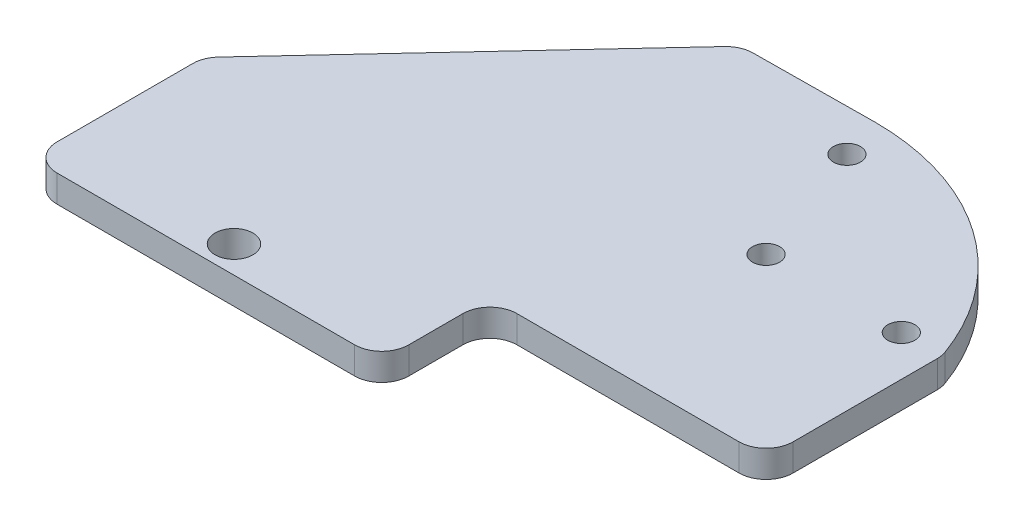
ISO-10303-21;
HEADER;
FILE_DESCRIPTION(('STEP AP214'),'2;1');
FILE_NAME('part.step','',(''),(''),'','','');
FILE_SCHEMA(('AUTOMOTIVE_DESIGN { 1 0 10303 214 1 1 1 1 }'));
ENDSEC;
DATA;
#1=APPLICATION_CONTEXT('core data for automotive mechanical design processes');
#2=APPLICATION_PROTOCOL_DEFINITION('international standard','automotive_design',2000,#1);
#3=PRODUCT_CONTEXT('',#1,'mechanical');
#4=PRODUCT('Part','Part','',(#3));
#5=PRODUCT_RELATED_PRODUCT_CATEGORY('part','',(#4));
#6=PRODUCT_DEFINITION_FORMATION('','',#4);
#7=PRODUCT_DEFINITION_CONTEXT('part definition',#1,'design');
#8=PRODUCT_DEFINITION('design','',#6,#7);
#9=PRODUCT_DEFINITION_SHAPE('','',#8);
#10=(LENGTH_UNIT() NAMED_UNIT(*) SI_UNIT(.MILLI.,.METRE.));
#11=(NAMED_UNIT(*) PLANE_ANGLE_UNIT() SI_UNIT($,.RADIAN.));
#12=(NAMED_UNIT(*) SI_UNIT($,.STERADIAN.) SOLID_ANGLE_UNIT());
#13=UNCERTAINTY_MEASURE_WITH_UNIT(LENGTH_MEASURE(1.E-05),#10,'distance_accuracy_value','');
#14=(GEOMETRIC_REPRESENTATION_CONTEXT(3) GLOBAL_UNCERTAINTY_ASSIGNED_CONTEXT((#13)) GLOBAL_UNIT_ASSIGNED_CONTEXT((#10,
#11,#12)) REPRESENTATION_CONTEXT('',''));
#15=CARTESIAN_POINT('',(0.,0.,0.));
#16=DIRECTION('',(0.,0.,1.));
#17=DIRECTION('',(1.,0.,0.));
#18=AXIS2_PLACEMENT_3D('',#15,#16,#17);
#19=CARTESIAN_POINT('',(-34.7983001151033,10.,-117.080751783085));
#20=DIRECTION('',(0.,-1.,0.));
#21=DIRECTION('',(0.,0.,-1.));
#22=AXIS2_PLACEMENT_3D('',#19,#20,#21);
#23=CYLINDRICAL_SURFACE('',#22,9.99999999999999);
#24=CARTESIAN_POINT('',(-34.7983001151033,0.,-117.080751783085));
#25=DIRECTION('',(0.,1.,0.));
#26=DIRECTION('',(0.,0.,-1.));
#27=AXIS2_PLACEMENT_3D('',#24,#25,#26);
#28=CIRCLE('',#27,9.99999999999999);
#29=CARTESIAN_POINT('',(-34.9535044317094,0.,-127.07954729155));
#30=VERTEX_POINT('',#29);
#31=CARTESIAN_POINT('',(-42.1194135361715,0.,-123.892601625518));
#32=VERTEX_POINT('',#31);
#33=EDGE_CURVE('E176',#30,#32,#28,.T.);
#34=ORIENTED_EDGE('',*,*,#33,.T.);
#35=DIRECTION('',(0.,-1.,0.));
#36=VECTOR('',#35,1.);
#37=CARTESIAN_POINT('',(-42.1194135361715,10.,-123.892601625518));
#38=LINE('',#37,#36);
#39=CARTESIAN_POINT('',(-42.1194135361715,10.,-123.892601625518));
#40=VERTEX_POINT('',#39);
#41=EDGE_CURVE('E11',#40,#32,#38,.T.);
#42=ORIENTED_EDGE('',*,*,#41,.F.);
#43=CARTESIAN_POINT('',(-34.7983001151033,10.,-117.080751783085));
#44=DIRECTION('',(0.,1.,0.));
#45=DIRECTION('',(0.,0.,-1.));
#46=AXIS2_PLACEMENT_3D('',#43,#44,#45);
#47=CIRCLE('',#46,9.99999999999999);
#48=CARTESIAN_POINT('',(-34.9535044317094,10.,-127.07954729155));
#49=VERTEX_POINT('',#48);
#50=EDGE_CURVE('E204',#49,#40,#47,.T.);
#51=ORIENTED_EDGE('',*,*,#50,.F.);
#52=DIRECTION('',(0.,-1.,0.));
#53=VECTOR('',#52,1.);
#54=CARTESIAN_POINT('',(-34.9535044317094,10.,-127.07954729155));
#55=LINE('',#54,#53);
#56=EDGE_CURVE('E172',#49,#30,#55,.T.);
#57=ORIENTED_EDGE('',*,*,#56,.T.);
#58=EDGE_LOOP('',(#34,#42,#51,#57));
#59=FACE_BOUND('',#58,.T.);
#60=ADVANCED_FACE('F36',(#59),#23,.T.);
#61=CARTESIAN_POINT('',(-132.321113421068,10.,-26.9472944173652));
#62=DIRECTION('',(0.732111342106818,0.,0.681184984243307));
#63=DIRECTION('',(0.681184984243307,0.,-0.732111342106818));
#64=AXIS2_PLACEMENT_3D('',#61,#62,#63);
#65=PLANE('',#64);
#66=DIRECTION('',(-0.681184984243307,0.,0.732111342106818));
#67=VECTOR('',#66,1.);
#68=CARTESIAN_POINT('',(-132.321113421068,0.,-26.9472944173652));
#69=LINE('',#68,#67);
#70=CARTESIAN_POINT('',(-132.321113421068,0.,-26.9472944173652));
#71=VERTEX_POINT('',#70);
#72=EDGE_CURVE('E179',#32,#71,#69,.T.);
#73=ORIENTED_EDGE('',*,*,#72,.T.);
#74=DIRECTION('',(0.,-1.,0.));
#75=VECTOR('',#74,1.);
#76=CARTESIAN_POINT('',(-132.321113421068,10.,-26.9472944173652));
#77=LINE('',#76,#75);
#78=CARTESIAN_POINT('',(-132.321113421068,10.,-26.9472944173652));
#79=VERTEX_POINT('',#78);
#80=EDGE_CURVE('E45',#79,#71,#77,.T.);
#81=ORIENTED_EDGE('',*,*,#80,.F.);
#82=DIRECTION('',(-0.681184984243307,0.,0.732111342106818));
#83=VECTOR('',#82,1.);
#84=CARTESIAN_POINT('',(-132.321113421068,10.,-26.9472944173652));
#85=LINE('',#84,#83);
#86=EDGE_CURVE('E118',#40,#79,#85,.T.);
#87=ORIENTED_EDGE('',*,*,#86,.F.);
#88=ORIENTED_EDGE('',*,*,#41,.T.);
#89=EDGE_LOOP('',(#73,#81,#87,#88));
#90=FACE_BOUND('',#89,.T.);
#91=ADVANCED_FACE('F275',(#90),#65,.F.);
#92=CARTESIAN_POINT('',(-125.,10.,-20.1354445749322));
#93=DIRECTION('',(0.,-1.,0.));
#94=DIRECTION('',(0.,0.,-1.));
#95=AXIS2_PLACEMENT_3D('',#92,#93,#94);
#96=CYLINDRICAL_SURFACE('',#95,9.99999999999999);
#97=CARTESIAN_POINT('',(-125.,0.,-20.1354445749322));
#98=DIRECTION('',(0.,1.,0.));
#99=DIRECTION('',(0.,0.,-1.));
#100=AXIS2_PLACEMENT_3D('',#97,#98,#99);
#101=CIRCLE('',#100,9.99999999999999);
#102=CARTESIAN_POINT('',(-135.,0.,-20.1354445749321));
#103=VERTEX_POINT('',#102);
#104=EDGE_CURVE('E181',#71,#103,#101,.T.);
#105=ORIENTED_EDGE('',*,*,#104,.T.);
#106=DIRECTION('',(0.,-1.,0.));
#107=VECTOR('',#106,1.);
#108=CARTESIAN_POINT('',(-135.,10.,-20.1354445749321));
#109=LINE('',#108,#107);
#110=CARTESIAN_POINT('',(-135.,10.,-20.1354445749321));
#111=VERTEX_POINT('',#110);
#112=EDGE_CURVE('E232',#111,#103,#109,.T.);
#113=ORIENTED_EDGE('',*,*,#112,.F.);
#114=CARTESIAN_POINT('',(-125.,10.,-20.1354445749322));
#115=DIRECTION('',(0.,1.,0.));
#116=DIRECTION('',(0.,0.,-1.));
#117=AXIS2_PLACEMENT_3D('',#114,#115,#116);
#118=CIRCLE('',#117,9.99999999999999);
#119=EDGE_CURVE('E407',#79,#111,#118,.T.);
#120=ORIENTED_EDGE('',*,*,#119,.F.);
#121=ORIENTED_EDGE('',*,*,#80,.T.);
#122=EDGE_LOOP('',(#105,#113,#120,#121));
#123=FACE_BOUND('',#122,.T.);
#124=ADVANCED_FACE('F279',(#123),#96,.T.);
#125=CARTESIAN_POINT('',(-135.,10.,30.0000000000002));
#126=DIRECTION('',(1.,0.,0.));
#127=DIRECTION('',(0.,0.,-1.));
#128=AXIS2_PLACEMENT_3D('',#125,#126,#127);
#129=PLANE('',#128);
#130=DIRECTION('',(0.,0.,1.));
#131=VECTOR('',#130,1.);
#132=CARTESIAN_POINT('',(-135.,0.,30.0000000000002));
#133=LINE('',#132,#131);
#134=CARTESIAN_POINT('',(-135.,0.,30.0000000000002));
#135=VERTEX_POINT('',#134);
#136=EDGE_CURVE('E183',#103,#135,#133,.T.);
#137=ORIENTED_EDGE('',*,*,#136,.T.);
#138=DIRECTION('',(0.,-1.,0.));
#139=VECTOR('',#138,1.);
#140=CARTESIAN_POINT('',(-135.,10.,30.0000000000002));
#141=LINE('',#140,#139);
#142=CARTESIAN_POINT('',(-135.,10.,30.0000000000002));
#143=VERTEX_POINT('',#142);
#144=EDGE_CURVE('E229',#143,#135,#141,.T.);
#145=ORIENTED_EDGE('',*,*,#144,.F.);
#146=DIRECTION('',(0.,0.,1.));
#147=VECTOR('',#146,1.);
#148=CARTESIAN_POINT('',(-135.,10.,30.0000000000002));
#149=LINE('',#148,#147);
#150=EDGE_CURVE('E409',#111,#143,#149,.T.);
#151=ORIENTED_EDGE('',*,*,#150,.F.);
#152=ORIENTED_EDGE('',*,*,#112,.T.);
#153=EDGE_LOOP('',(#137,#145,#151,#152));
#154=FACE_BOUND('',#153,.T.);
#155=ADVANCED_FACE('F283',(#154),#129,.F.);
#156=CARTESIAN_POINT('',(-125.,10.,30.0000000000002));
#157=DIRECTION('',(0.,-1.,0.));
#158=DIRECTION('',(0.,0.,-1.));
#159=AXIS2_PLACEMENT_3D('',#156,#157,#158);
#160=CYLINDRICAL_SURFACE('',#159,10.);
#161=CARTESIAN_POINT('',(-125.,0.,30.0000000000002));
#162=DIRECTION('',(0.,1.,0.));
#163=DIRECTION('',(0.,0.,-1.));
#164=AXIS2_PLACEMENT_3D('',#161,#162,#163);
#165=CIRCLE('',#164,10.);
#166=CARTESIAN_POINT('',(-125.,0.,40.0000000000002));
#167=VERTEX_POINT('',#166);
#168=EDGE_CURVE('E185',#135,#167,#165,.T.);
#169=ORIENTED_EDGE('',*,*,#168,.T.);
#170=DIRECTION('',(0.,-1.,0.));
#171=VECTOR('',#170,1.);
#172=CARTESIAN_POINT('',(-125.,10.,40.0000000000002));
#173=LINE('',#172,#171);
#174=CARTESIAN_POINT('',(-125.,10.,40.0000000000002));
#175=VERTEX_POINT('',#174);
#176=EDGE_CURVE('E226',#175,#167,#173,.T.);
#177=ORIENTED_EDGE('',*,*,#176,.F.);
#178=CARTESIAN_POINT('',(-125.,10.,30.0000000000002));
#179=DIRECTION('',(0.,1.,0.));
#180=DIRECTION('',(0.,0.,-1.));
#181=AXIS2_PLACEMENT_3D('',#178,#179,#180);
#182=CIRCLE('',#181,10.);
#183=EDGE_CURVE('E411',#143,#175,#182,.T.);
#184=ORIENTED_EDGE('',*,*,#183,.F.);
#185=ORIENTED_EDGE('',*,*,#144,.T.);
#186=EDGE_LOOP('',(#169,#177,#184,#185));
#187=FACE_BOUND('',#186,.T.);
#188=ADVANCED_FACE('F289',(#187),#160,.T.);
#189=CARTESIAN_POINT('',(-15.0000000000001,10.,40.0000000000002));
#190=DIRECTION('',(0.,0.,-1.));
#191=DIRECTION('',(-1.,0.,0.));
#192=AXIS2_PLACEMENT_3D('',#189,#190,#191);
#193=PLANE('',#192);
#194=DIRECTION('',(1.,0.,0.));
#195=VECTOR('',#194,1.);
#196=CARTESIAN_POINT('',(-15.0000000000001,0.,40.0000000000002));
#197=LINE('',#196,#195);
#198=CARTESIAN_POINT('',(-15.0000000000001,0.,40.0000000000002));
#199=VERTEX_POINT('',#198);
#200=EDGE_CURVE('E187',#167,#199,#197,.T.);
#201=ORIENTED_EDGE('',*,*,#200,.T.);
#202=DIRECTION('',(0.,-1.,0.));
#203=VECTOR('',#202,1.);
#204=CARTESIAN_POINT('',(-15.0000000000001,10.,40.0000000000002));
#205=LINE('',#204,#203);
#206=CARTESIAN_POINT('',(-15.0000000000001,10.,40.0000000000002));
#207=VERTEX_POINT('',#206);
#208=EDGE_CURVE('E223',#207,#199,#205,.T.);
#209=ORIENTED_EDGE('',*,*,#208,.F.);
#210=DIRECTION('',(1.,0.,0.));
#211=VECTOR('',#210,1.);
#212=CARTESIAN_POINT('',(-15.0000000000001,10.,40.0000000000002));
#213=LINE('',#212,#211);
#214=EDGE_CURVE('E413',#175,#207,#213,.T.);
#215=ORIENTED_EDGE('',*,*,#214,.F.);
#216=ORIENTED_EDGE('',*,*,#176,.T.);
#217=EDGE_LOOP('',(#201,#209,#215,#216));
#218=FACE_BOUND('',#217,.T.);
#219=ADVANCED_FACE('F293',(#218),#193,.F.);
#220=CARTESIAN_POINT('',(-15.0000000000001,10.,30.0000000000002));
#221=DIRECTION('',(0.,-1.,0.));
#222=DIRECTION('',(0.,0.,-1.));
#223=AXIS2_PLACEMENT_3D('',#220,#221,#222);
#224=CYLINDRICAL_SURFACE('',#223,10.);
#225=CARTESIAN_POINT('',(-15.0000000000001,0.,30.0000000000002));
#226=DIRECTION('',(0.,1.,0.));
#227=DIRECTION('',(0.,0.,1.));
#228=AXIS2_PLACEMENT_3D('',#225,#226,#227);
#229=CIRCLE('',#228,10.);
#230=CARTESIAN_POINT('',(-5.00000000000007,0.,30.0000000000002));
#231=VERTEX_POINT('',#230);
#232=EDGE_CURVE('E189',#199,#231,#229,.T.);
#233=ORIENTED_EDGE('',*,*,#232,.T.);
#234=DIRECTION('',(0.,-1.,0.));
#235=VECTOR('',#234,1.);
#236=CARTESIAN_POINT('',(-5.00000000000007,10.,30.0000000000002));
#237=LINE('',#236,#235);
#238=CARTESIAN_POINT('',(-5.00000000000007,10.,30.0000000000002));
#239=VERTEX_POINT('',#238);
#240=EDGE_CURVE('E220',#239,#231,#237,.T.);
#241=ORIENTED_EDGE('',*,*,#240,.F.);
#242=CARTESIAN_POINT('',(-15.0000000000001,10.,30.0000000000002));
#243=DIRECTION('',(0.,1.,0.));
#244=DIRECTION('',(0.,0.,1.));
#245=AXIS2_PLACEMENT_3D('',#242,#243,#244);
#246=CIRCLE('',#245,10.);
#247=EDGE_CURVE('E415',#207,#239,#246,.T.);
#248=ORIENTED_EDGE('',*,*,#247,.F.);
#249=ORIENTED_EDGE('',*,*,#208,.T.);
#250=EDGE_LOOP('',(#233,#241,#248,#249));
#251=FACE_BOUND('',#250,.T.);
#252=ADVANCED_FACE('F297',(#251),#224,.T.);
#253=CARTESIAN_POINT('',(-5.00000000000007,10.,10.0000000000001));
#254=DIRECTION('',(-1.,0.,0.));
#255=DIRECTION('',(0.,0.,1.));
#256=AXIS2_PLACEMENT_3D('',#253,#254,#255);
#257=PLANE('',#256);
#258=DIRECTION('',(0.,0.,-1.));
#259=VECTOR('',#258,1.);
#260=CARTESIAN_POINT('',(-5.00000000000007,0.,10.0000000000001));
#261=LINE('',#260,#259);
#262=CARTESIAN_POINT('',(-5.00000000000007,0.,10.0000000000001));
#263=VERTEX_POINT('',#262);
#264=EDGE_CURVE('E191',#231,#263,#261,.T.);
#265=ORIENTED_EDGE('',*,*,#264,.T.);
#266=DIRECTION('',(0.,-1.,0.));
#267=VECTOR('',#266,1.);
#268=CARTESIAN_POINT('',(-5.00000000000007,10.,10.0000000000001));
#269=LINE('',#268,#267);
#270=CARTESIAN_POINT('',(-5.00000000000007,10.,10.0000000000001));
#271=VERTEX_POINT('',#270);
#272=EDGE_CURVE('E217',#271,#263,#269,.T.);
#273=ORIENTED_EDGE('',*,*,#272,.F.);
#274=DIRECTION('',(0.,0.,-1.));
#275=VECTOR('',#274,1.);
#276=CARTESIAN_POINT('',(-5.00000000000007,10.,10.0000000000001));
#277=LINE('',#276,#275);
#278=EDGE_CURVE('E417',#239,#271,#277,.T.);
#279=ORIENTED_EDGE('',*,*,#278,.F.);
#280=ORIENTED_EDGE('',*,*,#240,.T.);
#281=EDGE_LOOP('',(#265,#273,#279,#280));
#282=FACE_BOUND('',#281,.T.);
#283=ADVANCED_FACE('F301',(#282),#257,.F.);
#284=CARTESIAN_POINT('',(4.99999999999992,10.,10.));
#285=DIRECTION('',(0.,-1.,0.));
#286=DIRECTION('',(0.,0.,-1.));
#287=AXIS2_PLACEMENT_3D('',#284,#285,#286);
#288=CYLINDRICAL_SURFACE('',#287,10.);
#289=CARTESIAN_POINT('',(4.99999999999992,0.,10.));
#290=DIRECTION('',(0.,-1.,0.));
#291=DIRECTION('',(0.,0.,-1.));
#292=AXIS2_PLACEMENT_3D('',#289,#290,#291);
#293=CIRCLE('',#292,10.);
#294=CARTESIAN_POINT('',(4.99999999999992,0.,0.));
#295=VERTEX_POINT('',#294);
#296=EDGE_CURVE('E193',#263,#295,#293,.T.);
#297=ORIENTED_EDGE('',*,*,#296,.T.);
#298=DIRECTION('',(0.,-1.,0.));
#299=VECTOR('',#298,1.);
#300=CARTESIAN_POINT('',(4.99999999999992,10.,0.));
#301=LINE('',#300,#299);
#302=CARTESIAN_POINT('',(4.99999999999992,10.,0.));
#303=VERTEX_POINT('',#302);
#304=EDGE_CURVE('E214',#303,#295,#301,.T.);
#305=ORIENTED_EDGE('',*,*,#304,.F.);
#306=CARTESIAN_POINT('',(4.99999999999992,10.,10.));
#307=DIRECTION('',(0.,-1.,0.));
#308=DIRECTION('',(0.,0.,-1.));
#309=AXIS2_PLACEMENT_3D('',#306,#307,#308);
#310=CIRCLE('',#309,10.);
#311=EDGE_CURVE('E419',#271,#303,#310,.T.);
#312=ORIENTED_EDGE('',*,*,#311,.F.);
#313=ORIENTED_EDGE('',*,*,#272,.T.);
#314=EDGE_LOOP('',(#297,#305,#312,#313));
#315=FACE_BOUND('',#314,.T.);
#316=ADVANCED_FACE('F305',(#315),#288,.F.);
#317=CARTESIAN_POINT('',(5.,10.,0.));
#318=DIRECTION('',(0.,0.,-1.));
#319=DIRECTION('',(-1.,0.,0.));
#320=AXIS2_PLACEMENT_3D('',#317,#318,#319);
#321=PLANE('',#320);
#322=DIRECTION('',(1.,0.,0.));
#323=VECTOR('',#322,1.);
#324=CARTESIAN_POINT('',(5.,0.,0.));
#325=LINE('',#324,#323);
#326=CARTESIAN_POINT('',(87.0999999999999,0.,0.));
#327=VERTEX_POINT('',#326);
#328=EDGE_CURVE('E195',#295,#327,#325,.T.);
#329=ORIENTED_EDGE('',*,*,#328,.T.);
#330=DIRECTION('',(0.,-1.,0.));
#331=VECTOR('',#330,1.);
#332=CARTESIAN_POINT('',(87.0999999999999,10.,0.));
#333=LINE('',#332,#331);
#334=CARTESIAN_POINT('',(87.0999999999999,10.,0.));
#335=VERTEX_POINT('',#334);
#336=EDGE_CURVE('E211',#335,#327,#333,.T.);
#337=ORIENTED_EDGE('',*,*,#336,.F.);
#338=DIRECTION('',(1.,0.,0.));
#339=VECTOR('',#338,1.);
#340=CARTESIAN_POINT('',(5.,10.,0.));
#341=LINE('',#340,#339);
#342=EDGE_CURVE('E421',#303,#335,#341,.T.);
#343=ORIENTED_EDGE('',*,*,#342,.F.);
#344=ORIENTED_EDGE('',*,*,#304,.T.);
#345=EDGE_LOOP('',(#329,#337,#343,#344));
#346=FACE_BOUND('',#345,.T.);
#347=ADVANCED_FACE('F309',(#346),#321,.F.);
#348=CARTESIAN_POINT('',(87.1,10.,-10.));
#349=DIRECTION('',(0.,-1.,0.));
#350=DIRECTION('',(0.,0.,-1.));
#351=AXIS2_PLACEMENT_3D('',#348,#349,#350);
#352=CYLINDRICAL_SURFACE('',#351,10.);
#353=CARTESIAN_POINT('',(87.1,0.,-10.));
#354=DIRECTION('',(0.,1.,0.));
#355=DIRECTION('',(0.,0.,1.));
#356=AXIS2_PLACEMENT_3D('',#353,#354,#355);
#357=CIRCLE('',#356,10.);
#358=CARTESIAN_POINT('',(97.1,0.,-10.0000000000001));
#359=VERTEX_POINT('',#358);
#360=EDGE_CURVE('E197',#327,#359,#357,.T.);
#361=ORIENTED_EDGE('',*,*,#360,.T.);
#362=DIRECTION('',(0.,-1.,0.));
#363=VECTOR('',#362,1.);
#364=CARTESIAN_POINT('',(97.1,10.,-10.0000000000001));
#365=LINE('',#364,#363);
#366=CARTESIAN_POINT('',(97.1,10.,-10.0000000000001));
#367=VERTEX_POINT('',#366);
#368=EDGE_CURVE('E208',#367,#359,#365,.T.);
#369=ORIENTED_EDGE('',*,*,#368,.F.);
#370=CARTESIAN_POINT('',(87.1,10.,-10.));
#371=DIRECTION('',(0.,1.,0.));
#372=DIRECTION('',(0.,0.,1.));
#373=AXIS2_PLACEMENT_3D('',#370,#371,#372);
#374=CIRCLE('',#373,10.);
#375=EDGE_CURVE('E423',#335,#367,#374,.T.);
#376=ORIENTED_EDGE('',*,*,#375,.F.);
#377=ORIENTED_EDGE('',*,*,#336,.T.);
#378=EDGE_LOOP('',(#361,#369,#376,#377));
#379=FACE_BOUND('',#378,.T.);
#380=ADVANCED_FACE('F313',(#379),#352,.T.);
#381=CARTESIAN_POINT('',(97.1,10.,-10.0000000000001));
#382=DIRECTION('',(-1.,0.,0.));
#383=DIRECTION('',(0.,0.,1.));
#384=AXIS2_PLACEMENT_3D('',#381,#382,#383);
#385=PLANE('',#384);
#386=DIRECTION('',(0.,0.,-1.));
#387=VECTOR('',#386,1.);
#388=CARTESIAN_POINT('',(97.1,0.,-10.0000000000001));
#389=LINE('',#388,#387);
#390=CARTESIAN_POINT('',(97.1,0.,-63.2972088275292));
#391=VERTEX_POINT('',#390);
#392=EDGE_CURVE('E199',#359,#391,#389,.T.);
#393=ORIENTED_EDGE('',*,*,#392,.T.);
#394=DIRECTION('',(0.,-1.,0.));
#395=VECTOR('',#394,1.);
#396=CARTESIAN_POINT('',(97.1,10.,-63.2972088275292));
#397=LINE('',#396,#395);
#398=CARTESIAN_POINT('',(97.1,10.,-63.2972088275292));
#399=VERTEX_POINT('',#398);
#400=EDGE_CURVE('E167',#399,#391,#397,.T.);
#401=ORIENTED_EDGE('',*,*,#400,.F.);
#402=DIRECTION('',(0.,0.,-1.));
#403=VECTOR('',#402,1.);
#404=CARTESIAN_POINT('',(97.1,10.,-10.0000000000001));
#405=LINE('',#404,#403);
#406=EDGE_CURVE('E158',#367,#399,#405,.T.);
#407=ORIENTED_EDGE('',*,*,#406,.F.);
#408=ORIENTED_EDGE('',*,*,#368,.T.);
#409=EDGE_LOOP('',(#393,#401,#407,#408));
#410=FACE_BOUND('',#409,.T.);
#411=ADVANCED_FACE('F317',(#410),#385,.F.);
#412=CARTESIAN_POINT('',(87.1,10.,-63.2972088275292));
#413=DIRECTION('',(0.,-1.,0.));
#414=DIRECTION('',(0.,0.,-1.));
#415=AXIS2_PLACEMENT_3D('',#412,#413,#414);
#416=CYLINDRICAL_SURFACE('',#415,9.99999999999999);
#417=CARTESIAN_POINT('',(87.1,0.,-63.2972088275292));
#418=DIRECTION('',(0.,1.,0.));
#419=DIRECTION('',(0.,0.,-1.));
#420=AXIS2_PLACEMENT_3D('',#417,#418,#419);
#421=CIRCLE('',#420,9.99999999999999);
#422=CARTESIAN_POINT('',(96.5026593383159,0.,-66.70161734702));
#423=VERTEX_POINT('',#422);
#424=EDGE_CURVE('E166',#391,#423,#421,.T.);
#425=ORIENTED_EDGE('',*,*,#424,.T.);
#426=DIRECTION('',(0.,-1.,0.));
#427=VECTOR('',#426,1.);
#428=CARTESIAN_POINT('',(96.5026593383159,10.,-66.70161734702));
#429=LINE('',#428,#427);
#430=CARTESIAN_POINT('',(96.5026593383159,10.,-66.70161734702));
#431=VERTEX_POINT('',#430);
#432=EDGE_CURVE('E163',#431,#423,#429,.T.);
#433=ORIENTED_EDGE('',*,*,#432,.F.);
#434=CARTESIAN_POINT('',(87.1,10.,-63.2972088275292));
#435=DIRECTION('',(0.,1.,0.));
#436=DIRECTION('',(0.,0.,-1.));
#437=AXIS2_PLACEMENT_3D('',#434,#435,#436);
#438=CIRCLE('',#437,9.99999999999999);
#439=EDGE_CURVE('E152',#399,#431,#438,.T.);
#440=ORIENTED_EDGE('',*,*,#439,.F.);
#441=ORIENTED_EDGE('',*,*,#400,.T.);
#442=EDGE_LOOP('',(#425,#433,#440,#441));
#443=FACE_BOUND('',#442,.T.);
#444=ADVANCED_FACE('F164',(#443),#416,.T.);
#445=CARTESIAN_POINT('',(9.82826310663928,10.,-35.3195325201867));
#446=DIRECTION('',(0.,-1.,0.));
#447=DIRECTION('',(0.,0.,-1.));
#448=AXIS2_PLACEMENT_3D('',#445,#446,#447);
#449=CYLINDRICAL_SURFACE('',#448,92.1807258064517);
#450=CARTESIAN_POINT('',(9.82826310663928,0.,-35.3195325201867));
#451=DIRECTION('',(0.,1.,0.));
#452=DIRECTION('',(0.,0.,-1.));
#453=AXIS2_PLACEMENT_3D('',#450,#451,#452);
#454=CIRCLE('',#453,92.1807258064517);
#455=CARTESIAN_POINT('',(10.0464955682906,0.,-127.5));
#456=VERTEX_POINT('',#455);
#457=EDGE_CURVE('E104',#423,#456,#454,.T.);
#458=ORIENTED_EDGE('',*,*,#457,.T.);
#459=DIRECTION('',(0.,-1.,0.));
#460=VECTOR('',#459,1.);
#461=CARTESIAN_POINT('',(10.0464955682906,10.,-127.5));
#462=LINE('',#461,#460);
#463=CARTESIAN_POINT('',(10.0464955682906,10.,-127.5));
#464=VERTEX_POINT('',#463);
#465=EDGE_CURVE('E168',#464,#456,#462,.T.);
#466=ORIENTED_EDGE('',*,*,#465,.F.);
#467=CARTESIAN_POINT('',(9.82826310663928,10.,-35.3195325201867));
#468=DIRECTION('',(0.,1.,0.));
#469=DIRECTION('',(0.,0.,-1.));
#470=AXIS2_PLACEMENT_3D('',#467,#468,#469);
#471=CIRCLE('',#470,92.1807258064517);
#472=EDGE_CURVE('E156',#431,#464,#471,.T.);
#473=ORIENTED_EDGE('',*,*,#472,.F.);
#474=ORIENTED_EDGE('',*,*,#432,.T.);
#475=EDGE_LOOP('',(#458,#466,#473,#474));
#476=FACE_BOUND('',#475,.T.);
#477=ADVANCED_FACE('F170',(#476),#449,.T.);
#478=CARTESIAN_POINT('',(-34.9535044317094,10.,-127.07954729155));
#479=DIRECTION('',(0.00934298571333686,0.,0.999956353356466));
#480=DIRECTION('',(0.999956353356466,0.,-0.00934298571333686));
#481=AXIS2_PLACEMENT_3D('',#478,#479,#480);
#482=PLANE('',#481);
#483=DIRECTION('',(-0.999956353356465,0.,0.00934298571333686));
#484=VECTOR('',#483,1.);
#485=CARTESIAN_POINT('',(-34.9535044317094,0.,-127.07954729155));
#486=LINE('',#485,#484);
#487=EDGE_CURVE('E110',#456,#30,#486,.T.);
#488=ORIENTED_EDGE('',*,*,#487,.T.);
#489=ORIENTED_EDGE('',*,*,#56,.F.);
#490=DIRECTION('',(-0.999956353356465,0.,0.00934298571333686));
#491=VECTOR('',#490,1.);
#492=CARTESIAN_POINT('',(-34.9535044317094,10.,-127.07954729155));
#493=LINE('',#492,#491);
#494=EDGE_CURVE('E54',#464,#49,#493,.T.);
#495=ORIENTED_EDGE('',*,*,#494,.F.);
#496=ORIENTED_EDGE('',*,*,#465,.T.);
#497=EDGE_LOOP('',(#488,#489,#495,#496));
#498=FACE_BOUND('',#497,.T.);
#499=ADVANCED_FACE('F264',(#498),#482,.F.);
#500=CARTESIAN_POINT('',(-34.7983001151033,10.,-117.080751783085));
#501=DIRECTION('',(0.,-1.,0.));
#502=DIRECTION('',(0.,0.,-1.));
#503=AXIS2_PLACEMENT_3D('',#500,#501,#502);
#504=PLANE('',#503);
#505=CARTESIAN_POINT('',(-69.6153846153847,10.,30.0000000000002));
#506=DIRECTION('',(0.,-1.,0.));
#507=DIRECTION('',(0.,0.,-1.));
#508=AXIS2_PLACEMENT_3D('',#505,#506,#507);
#509=CIRCLE('',#508,7.);
#510=CARTESIAN_POINT('',(-69.6153846153847,10.,23.0000000000002));
#511=VERTEX_POINT('',#510);
#512=EDGE_CURVE('E390',#511,#511,#509,.T.);
#513=ORIENTED_EDGE('',*,*,#512,.T.);
#514=EDGE_LOOP('',(#513));
#515=FACE_BOUND('',#514,.T.);
#516=CARTESIAN_POINT('',(14.9989928337167,10.,-111.984631039295));
#517=DIRECTION('',(0.,1.,0.));
#518=DIRECTION('',(0.,0.,1.));
#519=AXIS2_PLACEMENT_3D('',#516,#517,#518);
#520=CIRCLE('',#519,5.00000000000001);
#521=CARTESIAN_POINT('',(14.9989928337167,10.,-106.984631039295));
#522=VERTEX_POINT('',#521);
#523=EDGE_CURVE('E240',#522,#522,#520,.T.);
#524=ORIENTED_EDGE('',*,*,#523,.F.);
#525=EDGE_LOOP('',(#524));
#526=FACE_BOUND('',#525,.T.);
#527=CARTESIAN_POINT('',(82.1,10.,-65.));
#528=DIRECTION('',(0.,1.,0.));
#529=DIRECTION('',(0.,0.,1.));
#530=AXIS2_PLACEMENT_3D('',#527,#528,#529);
#531=CIRCLE('',#530,5.00000000000001);
#532=CARTESIAN_POINT('',(82.1,10.,-60.));
#533=VERTEX_POINT('',#532);
#534=EDGE_CURVE('E400',#533,#533,#531,.T.);
#535=ORIENTED_EDGE('',*,*,#534,.F.);
#536=EDGE_LOOP('',(#535));
#537=FACE_BOUND('',#536,.T.);
#538=CARTESIAN_POINT('',(32.1,10.,-65.));
#539=DIRECTION('',(0.,1.,0.));
#540=DIRECTION('',(0.,0.,1.));
#541=AXIS2_PLACEMENT_3D('',#538,#539,#540);
#542=CIRCLE('',#541,4.99999999999999);
#543=CARTESIAN_POINT('',(32.1,10.,-60.));
#544=VERTEX_POINT('',#543);
#545=EDGE_CURVE('E395',#544,#544,#542,.T.);
#546=ORIENTED_EDGE('',*,*,#545,.F.);
#547=EDGE_LOOP('',(#546));
#548=FACE_BOUND('',#547,.T.);
#549=ORIENTED_EDGE('',*,*,#50,.T.);
#550=ORIENTED_EDGE('',*,*,#86,.T.);
#551=ORIENTED_EDGE('',*,*,#119,.T.);
#552=ORIENTED_EDGE('',*,*,#150,.T.);
#553=ORIENTED_EDGE('',*,*,#183,.T.);
#554=ORIENTED_EDGE('',*,*,#214,.T.);
#555=ORIENTED_EDGE('',*,*,#247,.T.);
#556=ORIENTED_EDGE('',*,*,#278,.T.);
#557=ORIENTED_EDGE('',*,*,#311,.T.);
#558=ORIENTED_EDGE('',*,*,#342,.T.);
#559=ORIENTED_EDGE('',*,*,#375,.T.);
#560=ORIENTED_EDGE('',*,*,#406,.T.);
#561=ORIENTED_EDGE('',*,*,#439,.T.);
#562=ORIENTED_EDGE('',*,*,#472,.T.);
#563=ORIENTED_EDGE('',*,*,#494,.T.);
#564=EDGE_LOOP('',(#549,#550,#551,#552,#553,#554,#555,#556,#557,#558,#559,#560,#561,#562,#563));
#565=FACE_BOUND('',#564,.T.);
#566=ADVANCED_FACE('F154',(#515,#526,#537,#548,#565),#504,.F.);
#567=CARTESIAN_POINT('',(-34.7983001151033,0.,-117.080751783085));
#568=DIRECTION('',(0.,-1.,0.));
#569=DIRECTION('',(0.,0.,-1.));
#570=AXIS2_PLACEMENT_3D('',#567,#568,#569);
#571=PLANE('',#570);
#572=CARTESIAN_POINT('',(-69.6153846153847,0.,30.0000000000002));
#573=DIRECTION('',(0.,-1.,0.));
#574=DIRECTION('',(0.,0.,-1.));
#575=AXIS2_PLACEMENT_3D('',#572,#573,#574);
#576=CIRCLE('',#575,7.);
#577=CARTESIAN_POINT('',(-69.6153846153847,0.,23.0000000000002));
#578=VERTEX_POINT('',#577);
#579=EDGE_CURVE('E393',#578,#578,#576,.T.);
#580=ORIENTED_EDGE('',*,*,#579,.F.);
#581=EDGE_LOOP('',(#580));
#582=FACE_BOUND('',#581,.T.);
#583=CARTESIAN_POINT('',(14.9989928337167,0.,-111.984631039295));
#584=DIRECTION('',(0.,-1.,0.));
#585=DIRECTION('',(0.,0.,-1.));
#586=AXIS2_PLACEMENT_3D('',#583,#584,#585);
#587=CIRCLE('',#586,5.00000000000001);
#588=CARTESIAN_POINT('',(14.9989928337167,0.,-116.984631039295));
#589=VERTEX_POINT('',#588);
#590=EDGE_CURVE('E39',#589,#589,#587,.T.);
#591=ORIENTED_EDGE('',*,*,#590,.F.);
#592=EDGE_LOOP('',(#591));
#593=FACE_BOUND('',#592,.T.);
#594=CARTESIAN_POINT('',(82.1,0.,-65.));
#595=DIRECTION('',(0.,-1.,0.));
#596=DIRECTION('',(0.,0.,-1.));
#597=AXIS2_PLACEMENT_3D('',#594,#595,#596);
#598=CIRCLE('',#597,5.00000000000001);
#599=CARTESIAN_POINT('',(82.1,0.,-70.));
#600=VERTEX_POINT('',#599);
#601=EDGE_CURVE('E239',#600,#600,#598,.T.);
#602=ORIENTED_EDGE('',*,*,#601,.F.);
#603=EDGE_LOOP('',(#602));
#604=FACE_BOUND('',#603,.T.);
#605=CARTESIAN_POINT('',(32.1,0.,-65.));
#606=DIRECTION('',(0.,-1.,0.));
#607=DIRECTION('',(0.,0.,-1.));
#608=AXIS2_PLACEMENT_3D('',#605,#606,#607);
#609=CIRCLE('',#608,4.99999999999999);
#610=CARTESIAN_POINT('',(32.1,0.,-70.));
#611=VERTEX_POINT('',#610);
#612=EDGE_CURVE('E237',#611,#611,#609,.T.);
#613=ORIENTED_EDGE('',*,*,#612,.F.);
#614=EDGE_LOOP('',(#613));
#615=FACE_BOUND('',#614,.T.);
#616=ORIENTED_EDGE('',*,*,#33,.F.);
#617=ORIENTED_EDGE('',*,*,#487,.F.);
#618=ORIENTED_EDGE('',*,*,#457,.F.);
#619=ORIENTED_EDGE('',*,*,#424,.F.);
#620=ORIENTED_EDGE('',*,*,#392,.F.);
#621=ORIENTED_EDGE('',*,*,#360,.F.);
#622=ORIENTED_EDGE('',*,*,#328,.F.);
#623=ORIENTED_EDGE('',*,*,#296,.F.);
#624=ORIENTED_EDGE('',*,*,#264,.F.);
#625=ORIENTED_EDGE('',*,*,#232,.F.);
#626=ORIENTED_EDGE('',*,*,#200,.F.);
#627=ORIENTED_EDGE('',*,*,#168,.F.);
#628=ORIENTED_EDGE('',*,*,#136,.F.);
#629=ORIENTED_EDGE('',*,*,#104,.F.);
#630=ORIENTED_EDGE('',*,*,#72,.F.);
#631=EDGE_LOOP('',(#616,#617,#618,#619,#620,#621,#622,#623,#624,#625,#626,#627,#628,#629,#630));
#632=FACE_BOUND('',#631,.T.);
#633=ADVANCED_FACE('F250',(#582,#593,#604,#615,#632),#571,.T.);
#634=CARTESIAN_POINT('',(32.1,-1.2E-05,-65.));
#635=DIRECTION('',(0.,1.,0.));
#636=DIRECTION('',(0.,0.,1.));
#637=AXIS2_PLACEMENT_3D('',#634,#635,#636);
#638=CYLINDRICAL_SURFACE('',#637,4.99999999999999);
#639=ORIENTED_EDGE('',*,*,#612,.T.);
#640=EDGE_LOOP('',(#639));
#641=FACE_BOUND('',#640,.T.);
#642=ORIENTED_EDGE('',*,*,#545,.T.);
#643=EDGE_LOOP('',(#642));
#644=FACE_BOUND('',#643,.T.);
#645=ADVANCED_FACE('F253',(#641,#644),#638,.F.);
#646=CARTESIAN_POINT('',(82.1,-1.2E-05,-65.));
#647=DIRECTION('',(0.,1.,0.));
#648=DIRECTION('',(0.,0.,1.));
#649=AXIS2_PLACEMENT_3D('',#646,#647,#648);
#650=CYLINDRICAL_SURFACE('',#649,5.00000000000001);
#651=ORIENTED_EDGE('',*,*,#601,.T.);
#652=EDGE_LOOP('',(#651));
#653=FACE_BOUND('',#652,.T.);
#654=ORIENTED_EDGE('',*,*,#534,.T.);
#655=EDGE_LOOP('',(#654));
#656=FACE_BOUND('',#655,.T.);
#657=ADVANCED_FACE('F345',(#653,#656),#650,.F.);
#658=CARTESIAN_POINT('',(14.9989928337167,-1.2E-05,-111.984631039295));
#659=DIRECTION('',(0.,1.,0.));
#660=DIRECTION('',(0.,0.,1.));
#661=AXIS2_PLACEMENT_3D('',#658,#659,#660);
#662=CYLINDRICAL_SURFACE('',#661,5.00000000000001);
#663=ORIENTED_EDGE('',*,*,#590,.T.);
#664=EDGE_LOOP('',(#663));
#665=FACE_BOUND('',#664,.T.);
#666=ORIENTED_EDGE('',*,*,#523,.T.);
#667=EDGE_LOOP('',(#666));
#668=FACE_BOUND('',#667,.T.);
#669=ADVANCED_FACE('F247',(#665,#668),#662,.F.);
#670=CARTESIAN_POINT('',(-69.6153846153847,10.,30.0000000000002));
#671=DIRECTION('',(0.,-1.,0.));
#672=DIRECTION('',(0.,0.,-1.));
#673=AXIS2_PLACEMENT_3D('',#670,#671,#672);
#674=CYLINDRICAL_SURFACE('',#673,7.);
#675=ORIENTED_EDGE('',*,*,#512,.F.);
#676=EDGE_LOOP('',(#675));
#677=FACE_BOUND('',#676,.T.);
#678=ORIENTED_EDGE('',*,*,#579,.T.);
#679=EDGE_LOOP('',(#678));
#680=FACE_BOUND('',#679,.T.);
#681=ADVANCED_FACE('F364',(#677,#680),#674,.F.);
#682=CLOSED_SHELL('',(#60,#91,#124,#155,#188,#219,#252,#283,#316,#347,#380,#411,#444,#477,#499,
#566,#633,#645,#657,#669,#681));
#683=MANIFOLD_SOLID_BREP('B2',#682);
#684=ADVANCED_BREP_SHAPE_REPRESENTATION('',(#18,#683),#14);
#685=SHAPE_DEFINITION_REPRESENTATION(#9,#684);
ENDSEC;
END-ISO-10303-21;
